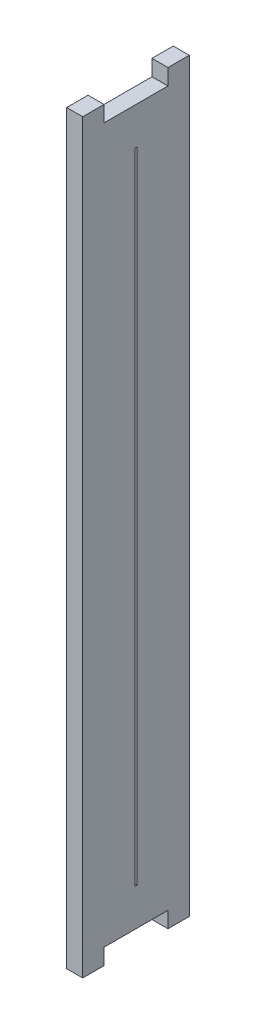
ISO-10303-21;
HEADER;
FILE_DESCRIPTION(('STEP AP214'),'2;1');
FILE_NAME('part.step','',(''),(''),'','','');
FILE_SCHEMA(('AUTOMOTIVE_DESIGN { 1 0 10303 214 1 1 1 1 }'));
ENDSEC;
DATA;
#1=APPLICATION_CONTEXT('core data for automotive mechanical design processes');
#2=APPLICATION_PROTOCOL_DEFINITION('international standard','automotive_design',2000,#1);
#3=PRODUCT_CONTEXT('',#1,'mechanical');
#4=PRODUCT('Part','Part','',(#3));
#5=PRODUCT_RELATED_PRODUCT_CATEGORY('part','',(#4));
#6=PRODUCT_DEFINITION_FORMATION('','',#4);
#7=PRODUCT_DEFINITION_CONTEXT('part definition',#1,'design');
#8=PRODUCT_DEFINITION('design','',#6,#7);
#9=PRODUCT_DEFINITION_SHAPE('','',#8);
#10=(LENGTH_UNIT() NAMED_UNIT(*) SI_UNIT(.MILLI.,.METRE.));
#11=(NAMED_UNIT(*) PLANE_ANGLE_UNIT() SI_UNIT($,.RADIAN.));
#12=(NAMED_UNIT(*) SI_UNIT($,.STERADIAN.) SOLID_ANGLE_UNIT());
#13=UNCERTAINTY_MEASURE_WITH_UNIT(LENGTH_MEASURE(1.E-05),#10,'distance_accuracy_value','');
#14=(GEOMETRIC_REPRESENTATION_CONTEXT(3) GLOBAL_UNCERTAINTY_ASSIGNED_CONTEXT((#13)) GLOBAL_UNIT_ASSIGNED_CONTEXT((#10,
#11,#12)) REPRESENTATION_CONTEXT('',''));
#15=CARTESIAN_POINT('',(0.,0.,0.));
#16=DIRECTION('',(0.,0.,1.));
#17=DIRECTION('',(1.,0.,0.));
#18=AXIS2_PLACEMENT_3D('',#15,#16,#17);
#19=CARTESIAN_POINT('',(1.5,-30.8441558441559,10.));
#20=DIRECTION('',(0.,1.,0.));
#21=DIRECTION('',(0.,0.,1.));
#22=AXIS2_PLACEMENT_3D('',#19,#20,#21);
#23=PLANE('',#22);
#24=DIRECTION('',(0.,0.,-1.));
#25=VECTOR('',#24,1.);
#26=CARTESIAN_POINT('',(0.,-30.8441558441559,10.));
#27=LINE('',#26,#25);
#28=CARTESIAN_POINT('',(0.,-30.8441558441559,10.));
#29=VERTEX_POINT('',#28);
#30=CARTESIAN_POINT('',(0.,-30.8441558441559,8.));
#31=VERTEX_POINT('',#30);
#32=EDGE_CURVE('E260',#29,#31,#27,.T.);
#33=ORIENTED_EDGE('',*,*,#32,.T.);
#34=DIRECTION('',(1.,0.,0.));
#35=VECTOR('',#34,1.);
#36=CARTESIAN_POINT('',(-8.5,-30.8441558441559,8.));
#37=LINE('',#36,#35);
#38=CARTESIAN_POINT('',(1.5,-30.8441558441559,8.));
#39=VERTEX_POINT('',#38);
#40=EDGE_CURVE('E199',#31,#39,#37,.T.);
#41=ORIENTED_EDGE('',*,*,#40,.T.);
#42=DIRECTION('',(0.,0.,-1.));
#43=VECTOR('',#42,1.);
#44=CARTESIAN_POINT('',(1.5,-30.8441558441559,10.));
#45=LINE('',#44,#43);
#46=CARTESIAN_POINT('',(1.5,-30.8441558441559,10.));
#47=VERTEX_POINT('',#46);
#48=EDGE_CURVE('E244',#47,#39,#45,.T.);
#49=ORIENTED_EDGE('',*,*,#48,.F.);
#50=DIRECTION('',(-1.,0.,0.));
#51=VECTOR('',#50,1.);
#52=CARTESIAN_POINT('',(1.5,-30.8441558441559,10.));
#53=LINE('',#52,#51);
#54=EDGE_CURVE('E282',#47,#29,#53,.T.);
#55=ORIENTED_EDGE('',*,*,#54,.T.);
#56=EDGE_LOOP('',(#33,#41,#49,#55));
#57=FACE_BOUND('',#56,.T.);
#58=ADVANCED_FACE('F39',(#57),#23,.F.);
#59=CARTESIAN_POINT('',(1.5,39.1558441558441,10.));
#60=DIRECTION('',(0.,-1.,0.));
#61=DIRECTION('',(0.,0.,-1.));
#62=AXIS2_PLACEMENT_3D('',#59,#60,#61);
#63=PLANE('',#62);
#64=DIRECTION('',(0.,0.,1.));
#65=VECTOR('',#64,1.);
#66=CARTESIAN_POINT('',(1.5,39.1558441558441,10.));
#67=LINE('',#66,#65);
#68=CARTESIAN_POINT('',(1.5,39.1558441558441,8.));
#69=VERTEX_POINT('',#68);
#70=CARTESIAN_POINT('',(1.5,39.1558441558441,10.));
#71=VERTEX_POINT('',#70);
#72=EDGE_CURVE('E251',#69,#71,#67,.T.);
#73=ORIENTED_EDGE('',*,*,#72,.F.);
#74=DIRECTION('',(1.,0.,0.));
#75=VECTOR('',#74,1.);
#76=CARTESIAN_POINT('',(-8.5,39.1558441558441,8.));
#77=LINE('',#76,#75);
#78=CARTESIAN_POINT('',(0.,39.1558441558441,8.));
#79=VERTEX_POINT('',#78);
#80=EDGE_CURVE('E167',#79,#69,#77,.T.);
#81=ORIENTED_EDGE('',*,*,#80,.F.);
#82=DIRECTION('',(0.,0.,1.));
#83=VECTOR('',#82,1.);
#84=CARTESIAN_POINT('',(0.,39.1558441558441,10.));
#85=LINE('',#84,#83);
#86=CARTESIAN_POINT('',(0.,39.1558441558441,10.));
#87=VERTEX_POINT('',#86);
#88=EDGE_CURVE('E267',#79,#87,#85,.T.);
#89=ORIENTED_EDGE('',*,*,#88,.T.);
#90=DIRECTION('',(-1.,0.,0.));
#91=VECTOR('',#90,1.);
#92=CARTESIAN_POINT('',(1.5,39.1558441558441,10.));
#93=LINE('',#92,#91);
#94=EDGE_CURVE('E255',#71,#87,#93,.T.);
#95=ORIENTED_EDGE('',*,*,#94,.F.);
#96=EDGE_LOOP('',(#73,#81,#89,#95));
#97=FACE_BOUND('',#96,.T.);
#98=ADVANCED_FACE('F320',(#97),#63,.F.);
#99=CARTESIAN_POINT('',(1.5,-30.8441558441559,10.));
#100=DIRECTION('',(0.,0.,-1.));
#101=DIRECTION('',(-1.,0.,0.));
#102=AXIS2_PLACEMENT_3D('',#99,#100,#101);
#103=PLANE('',#102);
#104=DIRECTION('',(0.,-1.,0.));
#105=VECTOR('',#104,1.);
#106=CARTESIAN_POINT('',(0.,-30.8441558441559,10.));
#107=LINE('',#106,#105);
#108=EDGE_CURVE('E228',#87,#29,#107,.T.);
#109=ORIENTED_EDGE('',*,*,#108,.T.);
#110=ORIENTED_EDGE('',*,*,#54,.F.);
#111=DIRECTION('',(0.,-1.,0.));
#112=VECTOR('',#111,1.);
#113=CARTESIAN_POINT('',(1.5,-30.8441558441559,10.));
#114=LINE('',#113,#112);
#115=EDGE_CURVE('E238',#71,#47,#114,.T.);
#116=ORIENTED_EDGE('',*,*,#115,.F.);
#117=ORIENTED_EDGE('',*,*,#94,.T.);
#118=EDGE_LOOP('',(#109,#110,#116,#117));
#119=FACE_BOUND('',#118,.T.);
#120=ADVANCED_FACE('F41',(#119),#103,.F.);
#121=CARTESIAN_POINT('',(1.5,-30.8441558441559,2.));
#122=VERTEX_POINT('',#121);
#123=CARTESIAN_POINT('',(1.5,-30.8441558441559,0.));
#124=VERTEX_POINT('',#123);
#125=EDGE_CURVE('E242',#122,#124,#45,.T.);
#126=ORIENTED_EDGE('',*,*,#125,.F.);
#127=DIRECTION('',(1.,0.,0.));
#128=VECTOR('',#127,1.);
#129=CARTESIAN_POINT('',(-8.5,-30.8441558441559,2.));
#130=LINE('',#129,#128);
#131=CARTESIAN_POINT('',(0.,-30.8441558441559,2.));
#132=VERTEX_POINT('',#131);
#133=EDGE_CURVE('E204',#132,#122,#130,.T.);
#134=ORIENTED_EDGE('',*,*,#133,.F.);
#135=CARTESIAN_POINT('',(0.,-30.8441558441559,0.));
#136=VERTEX_POINT('',#135);
#137=EDGE_CURVE('E259',#132,#136,#27,.T.);
#138=ORIENTED_EDGE('',*,*,#137,.T.);
#139=DIRECTION('',(-1.,0.,0.));
#140=VECTOR('',#139,1.);
#141=CARTESIAN_POINT('',(1.5,-30.8441558441559,0.));
#142=LINE('',#141,#140);
#143=EDGE_CURVE('E278',#124,#136,#142,.T.);
#144=ORIENTED_EDGE('',*,*,#143,.F.);
#145=EDGE_LOOP('',(#126,#134,#138,#144));
#146=FACE_BOUND('',#145,.T.);
#147=ADVANCED_FACE('F332',(#146),#23,.F.);
#148=CARTESIAN_POINT('',(1.5,-30.8441558441559,0.));
#149=DIRECTION('',(0.,0.,1.));
#150=DIRECTION('',(1.,0.,0.));
#151=AXIS2_PLACEMENT_3D('',#148,#149,#150);
#152=PLANE('',#151);
#153=DIRECTION('',(0.,1.,0.));
#154=VECTOR('',#153,1.);
#155=CARTESIAN_POINT('',(0.,-30.8441558441559,0.));
#156=LINE('',#155,#154);
#157=CARTESIAN_POINT('',(0.,39.1558441558441,0.));
#158=VERTEX_POINT('',#157);
#159=EDGE_CURVE('E264',#136,#158,#156,.T.);
#160=ORIENTED_EDGE('',*,*,#159,.T.);
#161=DIRECTION('',(-1.,0.,0.));
#162=VECTOR('',#161,1.);
#163=CARTESIAN_POINT('',(1.5,39.1558441558441,0.));
#164=LINE('',#163,#162);
#165=CARTESIAN_POINT('',(1.5,39.1558441558441,0.));
#166=VERTEX_POINT('',#165);
#167=EDGE_CURVE('E274',#166,#158,#164,.T.);
#168=ORIENTED_EDGE('',*,*,#167,.F.);
#169=DIRECTION('',(0.,1.,0.));
#170=VECTOR('',#169,1.);
#171=CARTESIAN_POINT('',(1.5,-30.8441558441559,0.));
#172=LINE('',#171,#170);
#173=EDGE_CURVE('E248',#124,#166,#172,.T.);
#174=ORIENTED_EDGE('',*,*,#173,.F.);
#175=ORIENTED_EDGE('',*,*,#143,.T.);
#176=EDGE_LOOP('',(#160,#168,#174,#175));
#177=FACE_BOUND('',#176,.T.);
#178=ADVANCED_FACE('F337',(#177),#152,.F.);
#179=CARTESIAN_POINT('',(0.,39.1558441558441,2.));
#180=VERTEX_POINT('',#179);
#181=EDGE_CURVE('E243',#158,#180,#85,.T.);
#182=ORIENTED_EDGE('',*,*,#181,.T.);
#183=DIRECTION('',(1.,0.,0.));
#184=VECTOR('',#183,1.);
#185=CARTESIAN_POINT('',(-8.5,39.1558441558441,2.));
#186=LINE('',#185,#184);
#187=CARTESIAN_POINT('',(1.5,39.1558441558441,2.));
#188=VERTEX_POINT('',#187);
#189=EDGE_CURVE('E183',#180,#188,#186,.T.);
#190=ORIENTED_EDGE('',*,*,#189,.T.);
#191=EDGE_CURVE('E252',#166,#188,#67,.T.);
#192=ORIENTED_EDGE('',*,*,#191,.F.);
#193=ORIENTED_EDGE('',*,*,#167,.T.);
#194=EDGE_LOOP('',(#182,#190,#192,#193));
#195=FACE_BOUND('',#194,.T.);
#196=ADVANCED_FACE('F340',(#195),#63,.F.);
#197=CARTESIAN_POINT('',(1.5,0.,0.));
#198=DIRECTION('',(-1.,0.,0.));
#199=DIRECTION('',(0.,0.,1.));
#200=AXIS2_PLACEMENT_3D('',#197,#198,#199);
#201=PLANE('',#200);
#202=DIRECTION('',(0.,0.,-1.));
#203=VECTOR('',#202,1.);
#204=CARTESIAN_POINT('',(1.5,-25.8441558441559,5.09999999999999));
#205=LINE('',#204,#203);
#206=CARTESIAN_POINT('',(1.5,-25.8441558441559,5.09999999999999));
#207=VERTEX_POINT('',#206);
#208=CARTESIAN_POINT('',(1.5,-25.8441558441559,4.89999999999999));
#209=VERTEX_POINT('',#208);
#210=EDGE_CURVE('E212',#207,#209,#205,.T.);
#211=ORIENTED_EDGE('',*,*,#210,.F.);
#212=DIRECTION('',(0.,-1.,0.));
#213=VECTOR('',#212,1.);
#214=CARTESIAN_POINT('',(1.5,34.1558441558442,5.1));
#215=LINE('',#214,#213);
#216=CARTESIAN_POINT('',(1.5,34.1558441558442,5.1));
#217=VERTEX_POINT('',#216);
#218=EDGE_CURVE('E182',#217,#207,#215,.T.);
#219=ORIENTED_EDGE('',*,*,#218,.F.);
#220=DIRECTION('',(0.,0.,1.));
#221=VECTOR('',#220,1.);
#222=CARTESIAN_POINT('',(1.5,34.1558441558442,5.1));
#223=LINE('',#222,#221);
#224=CARTESIAN_POINT('',(1.5,34.1558441558442,4.9));
#225=VERTEX_POINT('',#224);
#226=EDGE_CURVE('E220',#225,#217,#223,.T.);
#227=ORIENTED_EDGE('',*,*,#226,.F.);
#228=DIRECTION('',(0.,1.,0.));
#229=VECTOR('',#228,1.);
#230=CARTESIAN_POINT('',(1.5,34.1558441558442,4.9));
#231=LINE('',#230,#229);
#232=EDGE_CURVE('E216',#209,#225,#231,.T.);
#233=ORIENTED_EDGE('',*,*,#232,.F.);
#234=EDGE_LOOP('',(#211,#219,#227,#233));
#235=FACE_BOUND('',#234,.T.);
#236=DIRECTION('',(0.,0.,-1.));
#237=VECTOR('',#236,1.);
#238=CARTESIAN_POINT('',(1.5,37.6558441558441,8.));
#239=LINE('',#238,#237);
#240=CARTESIAN_POINT('',(1.5,37.6558441558441,8.));
#241=VERTEX_POINT('',#240);
#242=CARTESIAN_POINT('',(1.5,37.6558441558441,2.));
#243=VERTEX_POINT('',#242);
#244=EDGE_CURVE('E154',#241,#243,#239,.T.);
#245=ORIENTED_EDGE('',*,*,#244,.F.);
#246=DIRECTION('',(0.,-1.,0.));
#247=VECTOR('',#246,1.);
#248=CARTESIAN_POINT('',(1.5,39.1558441558441,8.));
#249=LINE('',#248,#247);
#250=EDGE_CURVE('E164',#69,#241,#249,.T.);
#251=ORIENTED_EDGE('',*,*,#250,.F.);
#252=ORIENTED_EDGE('',*,*,#72,.T.);
#253=ORIENTED_EDGE('',*,*,#115,.T.);
#254=ORIENTED_EDGE('',*,*,#48,.T.);
#255=DIRECTION('',(0.,-1.,0.));
#256=VECTOR('',#255,1.);
#257=CARTESIAN_POINT('',(1.5,-30.8441558441559,8.));
#258=LINE('',#257,#256);
#259=CARTESIAN_POINT('',(1.5,-29.3441558441559,8.));
#260=VERTEX_POINT('',#259);
#261=EDGE_CURVE('E189',#260,#39,#258,.T.);
#262=ORIENTED_EDGE('',*,*,#261,.F.);
#263=DIRECTION('',(0.,0.,1.));
#264=VECTOR('',#263,1.);
#265=CARTESIAN_POINT('',(1.5,-29.3441558441559,8.));
#266=LINE('',#265,#264);
#267=CARTESIAN_POINT('',(1.5,-29.3441558441559,2.));
#268=VERTEX_POINT('',#267);
#269=EDGE_CURVE('E195',#268,#260,#266,.T.);
#270=ORIENTED_EDGE('',*,*,#269,.F.);
#271=DIRECTION('',(0.,1.,0.));
#272=VECTOR('',#271,1.);
#273=CARTESIAN_POINT('',(1.5,-30.8441558441559,2.));
#274=LINE('',#273,#272);
#275=EDGE_CURVE('E192',#122,#268,#274,.T.);
#276=ORIENTED_EDGE('',*,*,#275,.F.);
#277=ORIENTED_EDGE('',*,*,#125,.T.);
#278=ORIENTED_EDGE('',*,*,#173,.T.);
#279=ORIENTED_EDGE('',*,*,#191,.T.);
#280=DIRECTION('',(0.,1.,0.));
#281=VECTOR('',#280,1.);
#282=CARTESIAN_POINT('',(1.5,39.1558441558441,2.));
#283=LINE('',#282,#281);
#284=EDGE_CURVE('E161',#243,#188,#283,.T.);
#285=ORIENTED_EDGE('',*,*,#284,.F.);
#286=EDGE_LOOP('',(#245,#251,#252,#253,#254,#262,#270,#276,#277,#278,#279,#285));
#287=FACE_BOUND('',#286,.T.);
#288=ADVANCED_FACE('F173',(#235,#287),#201,.F.);
#289=CARTESIAN_POINT('',(0.,0.,0.));
#290=DIRECTION('',(-1.,0.,0.));
#291=DIRECTION('',(0.,0.,1.));
#292=AXIS2_PLACEMENT_3D('',#289,#290,#291);
#293=PLANE('',#292);
#294=DIRECTION('',(0.,1.,0.));
#295=VECTOR('',#294,1.);
#296=CARTESIAN_POINT('',(0.,0.,7.99999999999995));
#297=LINE('',#296,#295);
#298=CARTESIAN_POINT('',(0.,37.6558441558441,8.));
#299=VERTEX_POINT('',#298);
#300=EDGE_CURVE('E11',#299,#79,#297,.T.);
#301=ORIENTED_EDGE('',*,*,#300,.F.);
#302=DIRECTION('',(0.,0.,1.));
#303=VECTOR('',#302,1.);
#304=CARTESIAN_POINT('',(0.,37.6558441558441,0.));
#305=LINE('',#304,#303);
#306=CARTESIAN_POINT('',(0.,37.6558441558441,2.));
#307=VERTEX_POINT('',#306);
#308=EDGE_CURVE('E157',#307,#299,#305,.T.);
#309=ORIENTED_EDGE('',*,*,#308,.F.);
#310=DIRECTION('',(0.,-1.,0.));
#311=VECTOR('',#310,1.);
#312=CARTESIAN_POINT('',(0.,0.,2.));
#313=LINE('',#312,#311);
#314=EDGE_CURVE('E48',#180,#307,#313,.T.);
#315=ORIENTED_EDGE('',*,*,#314,.F.);
#316=ORIENTED_EDGE('',*,*,#181,.F.);
#317=ORIENTED_EDGE('',*,*,#159,.F.);
#318=ORIENTED_EDGE('',*,*,#137,.F.);
#319=DIRECTION('',(0.,-1.,0.));
#320=VECTOR('',#319,1.);
#321=CARTESIAN_POINT('',(0.,0.,2.));
#322=LINE('',#321,#320);
#323=CARTESIAN_POINT('',(0.,-29.3441558441559,2.));
#324=VERTEX_POINT('',#323);
#325=EDGE_CURVE('E299',#324,#132,#322,.T.);
#326=ORIENTED_EDGE('',*,*,#325,.F.);
#327=DIRECTION('',(0.,0.,-1.));
#328=VECTOR('',#327,1.);
#329=CARTESIAN_POINT('',(0.,-29.3441558441559,0.));
#330=LINE('',#329,#328);
#331=CARTESIAN_POINT('',(0.,-29.3441558441559,8.));
#332=VERTEX_POINT('',#331);
#333=EDGE_CURVE('E302',#332,#324,#330,.T.);
#334=ORIENTED_EDGE('',*,*,#333,.F.);
#335=DIRECTION('',(0.,1.,0.));
#336=VECTOR('',#335,1.);
#337=CARTESIAN_POINT('',(0.,0.,7.99999999999996));
#338=LINE('',#337,#336);
#339=EDGE_CURVE('E305',#31,#332,#338,.T.);
#340=ORIENTED_EDGE('',*,*,#339,.F.);
#341=ORIENTED_EDGE('',*,*,#32,.F.);
#342=ORIENTED_EDGE('',*,*,#108,.F.);
#343=ORIENTED_EDGE('',*,*,#88,.F.);
#344=EDGE_LOOP('',(#301,#309,#315,#316,#317,#318,#326,#334,#340,#341,#342,#343));
#345=FACE_BOUND('',#344,.T.);
#346=DIRECTION('',(0.,1.,0.));
#347=VECTOR('',#346,1.);
#348=CARTESIAN_POINT('',(0.,0.,5.1));
#349=LINE('',#348,#347);
#350=CARTESIAN_POINT('',(0.,-25.8441558441559,5.09999999999999));
#351=VERTEX_POINT('',#350);
#352=CARTESIAN_POINT('',(0.,34.1558441558442,5.1));
#353=VERTEX_POINT('',#352);
#354=EDGE_CURVE('E296',#351,#353,#349,.T.);
#355=ORIENTED_EDGE('',*,*,#354,.F.);
#356=DIRECTION('',(0.,0.,1.));
#357=VECTOR('',#356,1.);
#358=CARTESIAN_POINT('',(0.,-25.8441558441559,0.));
#359=LINE('',#358,#357);
#360=CARTESIAN_POINT('',(0.,-25.8441558441559,4.89999999999999));
#361=VERTEX_POINT('',#360);
#362=EDGE_CURVE('E286',#361,#351,#359,.T.);
#363=ORIENTED_EDGE('',*,*,#362,.F.);
#364=DIRECTION('',(0.,-1.,0.));
#365=VECTOR('',#364,1.);
#366=CARTESIAN_POINT('',(0.,0.,4.9));
#367=LINE('',#366,#365);
#368=CARTESIAN_POINT('',(0.,34.1558441558442,4.9));
#369=VERTEX_POINT('',#368);
#370=EDGE_CURVE('E289',#369,#361,#367,.T.);
#371=ORIENTED_EDGE('',*,*,#370,.F.);
#372=DIRECTION('',(0.,0.,-1.));
#373=VECTOR('',#372,1.);
#374=CARTESIAN_POINT('',(0.,34.1558441558442,0.));
#375=LINE('',#374,#373);
#376=EDGE_CURVE('E293',#353,#369,#375,.T.);
#377=ORIENTED_EDGE('',*,*,#376,.F.);
#378=EDGE_LOOP('',(#355,#363,#371,#377));
#379=FACE_BOUND('',#378,.T.);
#380=ADVANCED_FACE('F315',(#345,#379),#293,.T.);
#381=CARTESIAN_POINT('',(-8.5,34.1558441558442,5.1));
#382=DIRECTION('',(0.,0.,1.));
#383=DIRECTION('',(0.,-1.,0.));
#384=AXIS2_PLACEMENT_3D('',#381,#382,#383);
#385=PLANE('',#384);
#386=ORIENTED_EDGE('',*,*,#354,.T.);
#387=DIRECTION('',(1.,0.,0.));
#388=VECTOR('',#387,1.);
#389=CARTESIAN_POINT('',(-8.5,34.1558441558442,5.1));
#390=LINE('',#389,#388);
#391=EDGE_CURVE('E225',#353,#217,#390,.T.);
#392=ORIENTED_EDGE('',*,*,#391,.T.);
#393=ORIENTED_EDGE('',*,*,#218,.T.);
#394=DIRECTION('',(1.,0.,0.));
#395=VECTOR('',#394,1.);
#396=CARTESIAN_POINT('',(-8.5,-25.8441558441559,5.09999999999999));
#397=LINE('',#396,#395);
#398=EDGE_CURVE('E224',#351,#207,#397,.T.);
#399=ORIENTED_EDGE('',*,*,#398,.F.);
#400=EDGE_LOOP('',(#386,#392,#393,#399));
#401=FACE_BOUND('',#400,.T.);
#402=ADVANCED_FACE('F371',(#401),#385,.F.);
#403=CARTESIAN_POINT('',(-8.5,34.1558441558442,5.1));
#404=DIRECTION('',(0.,1.,0.));
#405=DIRECTION('',(0.,0.,1.));
#406=AXIS2_PLACEMENT_3D('',#403,#404,#405);
#407=PLANE('',#406);
#408=ORIENTED_EDGE('',*,*,#376,.T.);
#409=DIRECTION('',(1.,0.,0.));
#410=VECTOR('',#409,1.);
#411=CARTESIAN_POINT('',(-8.5,34.1558441558442,4.9));
#412=LINE('',#411,#410);
#413=EDGE_CURVE('E229',#369,#225,#412,.T.);
#414=ORIENTED_EDGE('',*,*,#413,.T.);
#415=ORIENTED_EDGE('',*,*,#226,.T.);
#416=ORIENTED_EDGE('',*,*,#391,.F.);
#417=EDGE_LOOP('',(#408,#414,#415,#416));
#418=FACE_BOUND('',#417,.T.);
#419=ADVANCED_FACE('F377',(#418),#407,.F.);
#420=CARTESIAN_POINT('',(-8.5,34.1558441558442,4.9));
#421=DIRECTION('',(0.,0.,-1.));
#422=DIRECTION('',(0.,1.,0.));
#423=AXIS2_PLACEMENT_3D('',#420,#421,#422);
#424=PLANE('',#423);
#425=ORIENTED_EDGE('',*,*,#370,.T.);
#426=DIRECTION('',(1.,0.,0.));
#427=VECTOR('',#426,1.);
#428=CARTESIAN_POINT('',(-8.5,-25.8441558441559,4.89999999999999));
#429=LINE('',#428,#427);
#430=EDGE_CURVE('E232',#361,#209,#429,.T.);
#431=ORIENTED_EDGE('',*,*,#430,.T.);
#432=ORIENTED_EDGE('',*,*,#232,.T.);
#433=ORIENTED_EDGE('',*,*,#413,.F.);
#434=EDGE_LOOP('',(#425,#431,#432,#433));
#435=FACE_BOUND('',#434,.T.);
#436=ADVANCED_FACE('F382',(#435),#424,.F.);
#437=CARTESIAN_POINT('',(-8.5,-25.8441558441559,5.09999999999999));
#438=DIRECTION('',(0.,-1.,0.));
#439=DIRECTION('',(0.,0.,-1.));
#440=AXIS2_PLACEMENT_3D('',#437,#438,#439);
#441=PLANE('',#440);
#442=ORIENTED_EDGE('',*,*,#362,.T.);
#443=ORIENTED_EDGE('',*,*,#398,.T.);
#444=ORIENTED_EDGE('',*,*,#210,.T.);
#445=ORIENTED_EDGE('',*,*,#430,.F.);
#446=EDGE_LOOP('',(#442,#443,#444,#445));
#447=FACE_BOUND('',#446,.T.);
#448=ADVANCED_FACE('F379',(#447),#441,.F.);
#449=CARTESIAN_POINT('',(-8.5,-30.8441558441559,8.));
#450=DIRECTION('',(0.,0.,1.));
#451=DIRECTION('',(0.,-1.,0.));
#452=AXIS2_PLACEMENT_3D('',#449,#450,#451);
#453=PLANE('',#452);
#454=ORIENTED_EDGE('',*,*,#339,.T.);
#455=DIRECTION('',(1.,0.,0.));
#456=VECTOR('',#455,1.);
#457=CARTESIAN_POINT('',(-8.5,-29.3441558441559,8.));
#458=LINE('',#457,#456);
#459=EDGE_CURVE('E171',#332,#260,#458,.T.);
#460=ORIENTED_EDGE('',*,*,#459,.T.);
#461=ORIENTED_EDGE('',*,*,#261,.T.);
#462=ORIENTED_EDGE('',*,*,#40,.F.);
#463=EDGE_LOOP('',(#454,#460,#461,#462));
#464=FACE_BOUND('',#463,.T.);
#465=ADVANCED_FACE('F352',(#464),#453,.F.);
#466=CARTESIAN_POINT('',(-8.5,-29.3441558441559,8.));
#467=DIRECTION('',(0.,1.,0.));
#468=DIRECTION('',(0.,0.,1.));
#469=AXIS2_PLACEMENT_3D('',#466,#467,#468);
#470=PLANE('',#469);
#471=ORIENTED_EDGE('',*,*,#333,.T.);
#472=DIRECTION('',(1.,0.,0.));
#473=VECTOR('',#472,1.);
#474=CARTESIAN_POINT('',(-8.5,-29.3441558441559,2.));
#475=LINE('',#474,#473);
#476=EDGE_CURVE('E63',#324,#268,#475,.T.);
#477=ORIENTED_EDGE('',*,*,#476,.T.);
#478=ORIENTED_EDGE('',*,*,#269,.T.);
#479=ORIENTED_EDGE('',*,*,#459,.F.);
#480=EDGE_LOOP('',(#471,#477,#478,#479));
#481=FACE_BOUND('',#480,.T.);
#482=ADVANCED_FACE('F350',(#481),#470,.F.);
#483=CARTESIAN_POINT('',(-8.5,-30.8441558441559,2.));
#484=DIRECTION('',(0.,0.,-1.));
#485=DIRECTION('',(-1.,0.,0.));
#486=AXIS2_PLACEMENT_3D('',#483,#484,#485);
#487=PLANE('',#486);
#488=ORIENTED_EDGE('',*,*,#325,.T.);
#489=ORIENTED_EDGE('',*,*,#133,.T.);
#490=ORIENTED_EDGE('',*,*,#275,.T.);
#491=ORIENTED_EDGE('',*,*,#476,.F.);
#492=EDGE_LOOP('',(#488,#489,#490,#491));
#493=FACE_BOUND('',#492,.T.);
#494=ADVANCED_FACE('F345',(#493),#487,.F.);
#495=CARTESIAN_POINT('',(-8.5,39.1558441558441,8.));
#496=DIRECTION('',(0.,0.,1.));
#497=DIRECTION('',(0.,-1.,0.));
#498=AXIS2_PLACEMENT_3D('',#495,#496,#497);
#499=PLANE('',#498);
#500=ORIENTED_EDGE('',*,*,#300,.T.);
#501=ORIENTED_EDGE('',*,*,#80,.T.);
#502=ORIENTED_EDGE('',*,*,#250,.T.);
#503=DIRECTION('',(1.,0.,0.));
#504=VECTOR('',#503,1.);
#505=CARTESIAN_POINT('',(-8.5,37.6558441558441,8.));
#506=LINE('',#505,#504);
#507=EDGE_CURVE('E150',#299,#241,#506,.T.);
#508=ORIENTED_EDGE('',*,*,#507,.F.);
#509=EDGE_LOOP('',(#500,#501,#502,#508));
#510=FACE_BOUND('',#509,.T.);
#511=ADVANCED_FACE('F165',(#510),#499,.F.);
#512=CARTESIAN_POINT('',(-8.5,39.1558441558441,2.));
#513=DIRECTION('',(0.,0.,-1.));
#514=DIRECTION('',(-1.,0.,0.));
#515=AXIS2_PLACEMENT_3D('',#512,#513,#514);
#516=PLANE('',#515);
#517=ORIENTED_EDGE('',*,*,#314,.T.);
#518=DIRECTION('',(1.,0.,0.));
#519=VECTOR('',#518,1.);
#520=CARTESIAN_POINT('',(-8.5,37.6558441558441,2.));
#521=LINE('',#520,#519);
#522=EDGE_CURVE('E55',#307,#243,#521,.T.);
#523=ORIENTED_EDGE('',*,*,#522,.T.);
#524=ORIENTED_EDGE('',*,*,#284,.T.);
#525=ORIENTED_EDGE('',*,*,#189,.F.);
#526=EDGE_LOOP('',(#517,#523,#524,#525));
#527=FACE_BOUND('',#526,.T.);
#528=ADVANCED_FACE('F312',(#527),#516,.F.);
#529=CARTESIAN_POINT('',(-8.5,37.6558441558441,8.));
#530=DIRECTION('',(0.,-1.,0.));
#531=DIRECTION('',(0.,0.,-1.));
#532=AXIS2_PLACEMENT_3D('',#529,#530,#531);
#533=PLANE('',#532);
#534=ORIENTED_EDGE('',*,*,#308,.T.);
#535=ORIENTED_EDGE('',*,*,#507,.T.);
#536=ORIENTED_EDGE('',*,*,#244,.T.);
#537=ORIENTED_EDGE('',*,*,#522,.F.);
#538=EDGE_LOOP('',(#534,#535,#536,#537));
#539=FACE_BOUND('',#538,.T.);
#540=ADVANCED_FACE('F152',(#539),#533,.F.);
#541=CLOSED_SHELL('',(#58,#98,#120,#147,#178,#196,#288,#380,#402,#419,#436,#448,#465,#482,#494,
#511,#528,#540));
#542=MANIFOLD_SOLID_BREP('B2',#541);
#543=ADVANCED_BREP_SHAPE_REPRESENTATION('',(#18,#542),#14);
#544=SHAPE_DEFINITION_REPRESENTATION(#9,#543);
ENDSEC;
END-ISO-10303-21;
